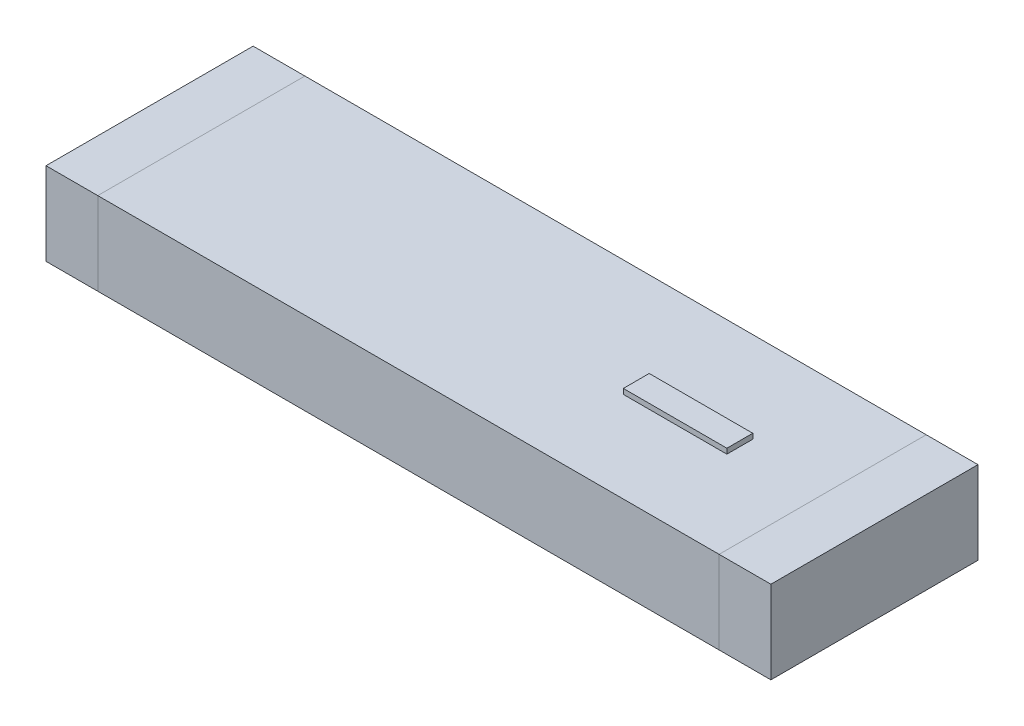
ISO-10303-21;
HEADER;
FILE_DESCRIPTION(('STEP AP214'),'2;1');
FILE_NAME('part.step','',(''),(''),'','','');
FILE_SCHEMA(('AUTOMOTIVE_DESIGN { 1 0 10303 214 1 1 1 1 }'));
ENDSEC;
DATA;
#1=APPLICATION_CONTEXT('core data for automotive mechanical design processes');
#2=APPLICATION_PROTOCOL_DEFINITION('international standard','automotive_design',2000,#1);
#3=PRODUCT_CONTEXT('',#1,'mechanical');
#4=PRODUCT('Part','Part','',(#3));
#5=PRODUCT_RELATED_PRODUCT_CATEGORY('part','',(#4));
#6=PRODUCT_DEFINITION_FORMATION('','',#4);
#7=PRODUCT_DEFINITION_CONTEXT('part definition',#1,'design');
#8=PRODUCT_DEFINITION('design','',#6,#7);
#9=PRODUCT_DEFINITION_SHAPE('','',#8);
#10=(LENGTH_UNIT() NAMED_UNIT(*) SI_UNIT(.MILLI.,.METRE.));
#11=(NAMED_UNIT(*) PLANE_ANGLE_UNIT() SI_UNIT($,.RADIAN.));
#12=(NAMED_UNIT(*) SI_UNIT($,.STERADIAN.) SOLID_ANGLE_UNIT());
#13=UNCERTAINTY_MEASURE_WITH_UNIT(LENGTH_MEASURE(1.E-05),#10,'distance_accuracy_value','');
#14=(GEOMETRIC_REPRESENTATION_CONTEXT(3) GLOBAL_UNCERTAINTY_ASSIGNED_CONTEXT((#13)) GLOBAL_UNIT_ASSIGNED_CONTEXT((#10,
#11,#12)) REPRESENTATION_CONTEXT('',''));
#15=CARTESIAN_POINT('',(0.,0.,0.));
#16=DIRECTION('',(0.,0.,1.));
#17=DIRECTION('',(1.,0.,0.));
#18=AXIS2_PLACEMENT_3D('',#15,#16,#17);
#19=CARTESIAN_POINT('',(2.2,0.75,0.125));
#20=DIRECTION('',(1.,0.,0.));
#21=DIRECTION('',(0.,0.,-1.));
#22=AXIS2_PLACEMENT_3D('',#19,#20,#21);
#23=PLANE('',#22);
#24=DIRECTION('',(0.,0.,-1.));
#25=VECTOR('',#24,1.);
#26=CARTESIAN_POINT('',(2.2,0.85,0.125));
#27=LINE('',#26,#25);
#28=CARTESIAN_POINT('',(2.2,0.85,0.125));
#29=VERTEX_POINT('',#28);
#30=CARTESIAN_POINT('',(2.2,0.85,-0.125));
#31=VERTEX_POINT('',#30);
#32=EDGE_CURVE('E108',#29,#31,#27,.T.);
#33=ORIENTED_EDGE('',*,*,#32,.F.);
#34=DIRECTION('',(0.,1.,0.));
#35=VECTOR('',#34,1.);
#36=CARTESIAN_POINT('',(2.2,0.75,0.125));
#37=LINE('',#36,#35);
#38=CARTESIAN_POINT('',(2.2,0.75,0.125));
#39=VERTEX_POINT('',#38);
#40=EDGE_CURVE('E12',#39,#29,#37,.T.);
#41=ORIENTED_EDGE('',*,*,#40,.F.);
#42=DIRECTION('',(0.,0.,-1.));
#43=VECTOR('',#42,1.);
#44=CARTESIAN_POINT('',(2.2,0.75,0.125));
#45=LINE('',#44,#43);
#46=CARTESIAN_POINT('',(2.2,0.75,-0.125));
#47=VERTEX_POINT('',#46);
#48=EDGE_CURVE('E102',#39,#47,#45,.T.);
#49=ORIENTED_EDGE('',*,*,#48,.T.);
#50=DIRECTION('',(0.,1.,0.));
#51=VECTOR('',#50,1.);
#52=CARTESIAN_POINT('',(2.2,0.75,-0.125));
#53=LINE('',#52,#51);
#54=EDGE_CURVE('E47',#47,#31,#53,.T.);
#55=ORIENTED_EDGE('',*,*,#54,.T.);
#56=EDGE_LOOP('',(#33,#41,#49,#55));
#57=FACE_BOUND('',#56,.T.);
#58=ADVANCED_FACE('F44',(#57),#23,.T.);
#59=CARTESIAN_POINT('',(1.2,0.75,0.125));
#60=DIRECTION('',(0.,0.,1.));
#61=DIRECTION('',(1.,0.,0.));
#62=AXIS2_PLACEMENT_3D('',#59,#60,#61);
#63=PLANE('',#62);
#64=DIRECTION('',(1.,0.,0.));
#65=VECTOR('',#64,1.);
#66=CARTESIAN_POINT('',(1.2,0.85,0.125));
#67=LINE('',#66,#65);
#68=CARTESIAN_POINT('',(1.2,0.85,0.125));
#69=VERTEX_POINT('',#68);
#70=EDGE_CURVE('E104',#69,#29,#67,.T.);
#71=ORIENTED_EDGE('',*,*,#70,.F.);
#72=DIRECTION('',(0.,1.,0.));
#73=VECTOR('',#72,1.);
#74=CARTESIAN_POINT('',(1.2,0.75,0.125));
#75=LINE('',#74,#73);
#76=CARTESIAN_POINT('',(1.2,0.75,0.125));
#77=VERTEX_POINT('',#76);
#78=EDGE_CURVE('E53',#77,#69,#75,.T.);
#79=ORIENTED_EDGE('',*,*,#78,.F.);
#80=DIRECTION('',(1.,0.,0.));
#81=VECTOR('',#80,1.);
#82=CARTESIAN_POINT('',(1.2,0.75,0.125));
#83=LINE('',#82,#81);
#84=EDGE_CURVE('E99',#77,#39,#83,.T.);
#85=ORIENTED_EDGE('',*,*,#84,.T.);
#86=ORIENTED_EDGE('',*,*,#40,.T.);
#87=EDGE_LOOP('',(#71,#79,#85,#86));
#88=FACE_BOUND('',#87,.T.);
#89=ADVANCED_FACE('F118',(#88),#63,.T.);
#90=CARTESIAN_POINT('',(1.2,0.75,0.125));
#91=DIRECTION('',(-1.,0.,0.));
#92=DIRECTION('',(0.,0.,1.));
#93=AXIS2_PLACEMENT_3D('',#90,#91,#92);
#94=PLANE('',#93);
#95=DIRECTION('',(0.,0.,1.));
#96=VECTOR('',#95,1.);
#97=CARTESIAN_POINT('',(1.2,0.85,0.125));
#98=LINE('',#97,#96);
#99=CARTESIAN_POINT('',(1.2,0.85,-0.125));
#100=VERTEX_POINT('',#99);
#101=EDGE_CURVE('E94',#100,#69,#98,.T.);
#102=ORIENTED_EDGE('',*,*,#101,.F.);
#103=DIRECTION('',(0.,1.,0.));
#104=VECTOR('',#103,1.);
#105=CARTESIAN_POINT('',(1.2,0.75,-0.125));
#106=LINE('',#105,#104);
#107=CARTESIAN_POINT('',(1.2,0.75,-0.125));
#108=VERTEX_POINT('',#107);
#109=EDGE_CURVE('E89',#108,#100,#106,.T.);
#110=ORIENTED_EDGE('',*,*,#109,.F.);
#111=DIRECTION('',(0.,0.,1.));
#112=VECTOR('',#111,1.);
#113=CARTESIAN_POINT('',(1.2,0.75,0.125));
#114=LINE('',#113,#112);
#115=EDGE_CURVE('E92',#108,#77,#114,.T.);
#116=ORIENTED_EDGE('',*,*,#115,.T.);
#117=ORIENTED_EDGE('',*,*,#78,.T.);
#118=EDGE_LOOP('',(#102,#110,#116,#117));
#119=FACE_BOUND('',#118,.T.);
#120=ADVANCED_FACE('F91',(#119),#94,.T.);
#121=CARTESIAN_POINT('',(1.2,0.75,-0.125));
#122=DIRECTION('',(0.,0.,-1.));
#123=DIRECTION('',(-1.,0.,0.));
#124=AXIS2_PLACEMENT_3D('',#121,#122,#123);
#125=PLANE('',#124);
#126=DIRECTION('',(-1.,0.,0.));
#127=VECTOR('',#126,1.);
#128=CARTESIAN_POINT('',(1.2,0.85,-0.125));
#129=LINE('',#128,#127);
#130=EDGE_CURVE('E111',#31,#100,#129,.T.);
#131=ORIENTED_EDGE('',*,*,#130,.F.);
#132=ORIENTED_EDGE('',*,*,#54,.F.);
#133=DIRECTION('',(-1.,0.,0.));
#134=VECTOR('',#133,1.);
#135=CARTESIAN_POINT('',(1.2,0.75,-0.125));
#136=LINE('',#135,#134);
#137=EDGE_CURVE('E98',#47,#108,#136,.T.);
#138=ORIENTED_EDGE('',*,*,#137,.T.);
#139=ORIENTED_EDGE('',*,*,#109,.T.);
#140=EDGE_LOOP('',(#131,#132,#138,#139));
#141=FACE_BOUND('',#140,.T.);
#142=ADVANCED_FACE('F101',(#141),#125,.T.);
#143=CARTESIAN_POINT('',(0.,0.75,0.));
#144=DIRECTION('',(0.,-1.,0.));
#145=DIRECTION('',(0.,0.,-1.));
#146=AXIS2_PLACEMENT_3D('',#143,#144,#145);
#147=PLANE('',#146);
#148=ORIENTED_EDGE('',*,*,#48,.F.);
#149=ORIENTED_EDGE('',*,*,#84,.F.);
#150=ORIENTED_EDGE('',*,*,#115,.F.);
#151=ORIENTED_EDGE('',*,*,#137,.F.);
#152=EDGE_LOOP('',(#148,#149,#150,#151));
#153=FACE_BOUND('',#152,.T.);
#154=ADVANCED_FACE('F97',(#153),#147,.T.);
#155=CARTESIAN_POINT('',(0.,0.85,0.));
#156=DIRECTION('',(0.,-1.,0.));
#157=DIRECTION('',(0.,0.,-1.));
#158=AXIS2_PLACEMENT_3D('',#155,#156,#157);
#159=PLANE('',#158);
#160=ORIENTED_EDGE('',*,*,#32,.T.);
#161=ORIENTED_EDGE('',*,*,#130,.T.);
#162=ORIENTED_EDGE('',*,*,#101,.T.);
#163=ORIENTED_EDGE('',*,*,#70,.T.);
#164=EDGE_LOOP('',(#160,#161,#162,#163));
#165=FACE_BOUND('',#164,.T.);
#166=ADVANCED_FACE('F117',(#165),#159,.F.);
#167=CLOSED_SHELL('',(#58,#89,#120,#142,#154,#166));
#168=MANIFOLD_SOLID_BREP('B2',#167);
#169=CARTESIAN_POINT('',(3.,0.8,-1.));
#170=DIRECTION('',(1.,0.,0.));
#171=DIRECTION('',(0.,0.,-1.));
#172=AXIS2_PLACEMENT_3D('',#169,#170,#171);
#173=PLANE('',#172);
#174=DIRECTION('',(0.,0.,1.));
#175=VECTOR('',#174,1.);
#176=CARTESIAN_POINT('',(3.,0.,-1.));
#177=LINE('',#176,#175);
#178=CARTESIAN_POINT('',(3.,0.,-1.));
#179=VERTEX_POINT('',#178);
#180=CARTESIAN_POINT('',(3.,0.,1.));
#181=VERTEX_POINT('',#180);
#182=EDGE_CURVE('E241',#179,#181,#177,.T.);
#183=ORIENTED_EDGE('',*,*,#182,.T.);
#184=DIRECTION('',(0.,-1.,0.));
#185=VECTOR('',#184,1.);
#186=CARTESIAN_POINT('',(3.,0.8,1.));
#187=LINE('',#186,#185);
#188=CARTESIAN_POINT('',(3.,0.8,1.));
#189=VERTEX_POINT('',#188);
#190=EDGE_CURVE('E42',#189,#181,#187,.T.);
#191=ORIENTED_EDGE('',*,*,#190,.F.);
#192=DIRECTION('',(0.,0.,1.));
#193=VECTOR('',#192,1.);
#194=CARTESIAN_POINT('',(3.,0.8,-1.));
#195=LINE('',#194,#193);
#196=CARTESIAN_POINT('',(3.,0.8,-1.));
#197=VERTEX_POINT('',#196);
#198=EDGE_CURVE('E229',#197,#189,#195,.T.);
#199=ORIENTED_EDGE('',*,*,#198,.F.);
#200=DIRECTION('',(0.,-1.,0.));
#201=VECTOR('',#200,1.);
#202=CARTESIAN_POINT('',(3.,0.8,-1.));
#203=LINE('',#202,#201);
#204=EDGE_CURVE('E237',#197,#179,#203,.T.);
#205=ORIENTED_EDGE('',*,*,#204,.T.);
#206=EDGE_LOOP('',(#183,#191,#199,#205));
#207=FACE_BOUND('',#206,.T.);
#208=ADVANCED_FACE('F178',(#207),#173,.F.);
#209=CARTESIAN_POINT('',(3.,0.8,1.));
#210=DIRECTION('',(0.,0.,-1.));
#211=DIRECTION('',(-1.,0.,0.));
#212=AXIS2_PLACEMENT_3D('',#209,#210,#211);
#213=PLANE('',#212);
#214=DIRECTION('',(1.,0.,0.));
#215=VECTOR('',#214,1.);
#216=CARTESIAN_POINT('',(3.,0.,1.));
#217=LINE('',#216,#215);
#218=CARTESIAN_POINT('',(3.5,0.,1.));
#219=VERTEX_POINT('',#218);
#220=EDGE_CURVE('E233',#181,#219,#217,.T.);
#221=ORIENTED_EDGE('',*,*,#220,.T.);
#222=DIRECTION('',(0.,-1.,0.));
#223=VECTOR('',#222,1.);
#224=CARTESIAN_POINT('',(3.5,0.8,1.));
#225=LINE('',#224,#223);
#226=CARTESIAN_POINT('',(3.5,0.8,1.));
#227=VERTEX_POINT('',#226);
#228=EDGE_CURVE('E186',#227,#219,#225,.T.);
#229=ORIENTED_EDGE('',*,*,#228,.F.);
#230=DIRECTION('',(1.,0.,0.));
#231=VECTOR('',#230,1.);
#232=CARTESIAN_POINT('',(3.,0.8,1.));
#233=LINE('',#232,#231);
#234=EDGE_CURVE('E224',#189,#227,#233,.T.);
#235=ORIENTED_EDGE('',*,*,#234,.F.);
#236=ORIENTED_EDGE('',*,*,#190,.T.);
#237=EDGE_LOOP('',(#221,#229,#235,#236));
#238=FACE_BOUND('',#237,.T.);
#239=ADVANCED_FACE('F232',(#238),#213,.F.);
#240=CARTESIAN_POINT('',(3.5,0.8,-1.));
#241=DIRECTION('',(-1.,0.,0.));
#242=DIRECTION('',(0.,0.,1.));
#243=AXIS2_PLACEMENT_3D('',#240,#241,#242);
#244=PLANE('',#243);
#245=DIRECTION('',(0.,0.,-1.));
#246=VECTOR('',#245,1.);
#247=CARTESIAN_POINT('',(3.5,0.,-1.));
#248=LINE('',#247,#246);
#249=CARTESIAN_POINT('',(3.5,0.,-1.));
#250=VERTEX_POINT('',#249);
#251=EDGE_CURVE('E211',#219,#250,#248,.T.);
#252=ORIENTED_EDGE('',*,*,#251,.T.);
#253=DIRECTION('',(0.,-1.,0.));
#254=VECTOR('',#253,1.);
#255=CARTESIAN_POINT('',(3.5,0.8,-1.));
#256=LINE('',#255,#254);
#257=CARTESIAN_POINT('',(3.5,0.8,-1.));
#258=VERTEX_POINT('',#257);
#259=EDGE_CURVE('E234',#258,#250,#256,.T.);
#260=ORIENTED_EDGE('',*,*,#259,.F.);
#261=DIRECTION('',(0.,0.,-1.));
#262=VECTOR('',#261,1.);
#263=CARTESIAN_POINT('',(3.5,0.8,-1.));
#264=LINE('',#263,#262);
#265=EDGE_CURVE('E227',#227,#258,#264,.T.);
#266=ORIENTED_EDGE('',*,*,#265,.F.);
#267=ORIENTED_EDGE('',*,*,#228,.T.);
#268=EDGE_LOOP('',(#252,#260,#266,#267));
#269=FACE_BOUND('',#268,.T.);
#270=ADVANCED_FACE('F235',(#269),#244,.F.);
#271=CARTESIAN_POINT('',(3.,0.8,-1.));
#272=DIRECTION('',(0.,0.,1.));
#273=DIRECTION('',(1.,0.,0.));
#274=AXIS2_PLACEMENT_3D('',#271,#272,#273);
#275=PLANE('',#274);
#276=DIRECTION('',(-1.,0.,0.));
#277=VECTOR('',#276,1.);
#278=CARTESIAN_POINT('',(3.,0.,-1.));
#279=LINE('',#278,#277);
#280=EDGE_CURVE('E217',#250,#179,#279,.T.);
#281=ORIENTED_EDGE('',*,*,#280,.T.);
#282=ORIENTED_EDGE('',*,*,#204,.F.);
#283=DIRECTION('',(-1.,0.,0.));
#284=VECTOR('',#283,1.);
#285=CARTESIAN_POINT('',(3.,0.8,-1.));
#286=LINE('',#285,#284);
#287=EDGE_CURVE('E194',#258,#197,#286,.T.);
#288=ORIENTED_EDGE('',*,*,#287,.F.);
#289=ORIENTED_EDGE('',*,*,#259,.T.);
#290=EDGE_LOOP('',(#281,#282,#288,#289));
#291=FACE_BOUND('',#290,.T.);
#292=ADVANCED_FACE('F248',(#291),#275,.F.);
#293=CARTESIAN_POINT('',(0.,0.8,0.));
#294=DIRECTION('',(0.,1.,0.));
#295=DIRECTION('',(0.,0.,1.));
#296=AXIS2_PLACEMENT_3D('',#293,#294,#295);
#297=PLANE('',#296);
#298=ORIENTED_EDGE('',*,*,#198,.T.);
#299=ORIENTED_EDGE('',*,*,#234,.T.);
#300=ORIENTED_EDGE('',*,*,#265,.T.);
#301=ORIENTED_EDGE('',*,*,#287,.T.);
#302=EDGE_LOOP('',(#298,#299,#300,#301));
#303=FACE_BOUND('',#302,.T.);
#304=ADVANCED_FACE('F225',(#303),#297,.T.);
#305=CARTESIAN_POINT('',(0.,0.,0.));
#306=DIRECTION('',(0.,1.,0.));
#307=DIRECTION('',(0.,0.,1.));
#308=AXIS2_PLACEMENT_3D('',#305,#306,#307);
#309=PLANE('',#308);
#310=ORIENTED_EDGE('',*,*,#182,.F.);
#311=ORIENTED_EDGE('',*,*,#280,.F.);
#312=ORIENTED_EDGE('',*,*,#251,.F.);
#313=ORIENTED_EDGE('',*,*,#220,.F.);
#314=EDGE_LOOP('',(#310,#311,#312,#313));
#315=FACE_BOUND('',#314,.T.);
#316=ADVANCED_FACE('F251',(#315),#309,.F.);
#317=CLOSED_SHELL('',(#208,#239,#270,#292,#304,#316));
#318=MANIFOLD_SOLID_BREP('B6',#317);
#319=CARTESIAN_POINT('',(-3.,0.8,-1.));
#320=DIRECTION('',(-1.,0.,0.));
#321=DIRECTION('',(0.,0.,1.));
#322=AXIS2_PLACEMENT_3D('',#319,#320,#321);
#323=PLANE('',#322);
#324=DIRECTION('',(0.,0.,-1.));
#325=VECTOR('',#324,1.);
#326=CARTESIAN_POINT('',(-3.,0.,-1.));
#327=LINE('',#326,#325);
#328=CARTESIAN_POINT('',(-3.,0.,1.));
#329=VERTEX_POINT('',#328);
#330=CARTESIAN_POINT('',(-3.,0.,-1.));
#331=VERTEX_POINT('',#330);
#332=EDGE_CURVE('E374',#329,#331,#327,.T.);
#333=ORIENTED_EDGE('',*,*,#332,.T.);
#334=DIRECTION('',(0.,-1.,0.));
#335=VECTOR('',#334,1.);
#336=CARTESIAN_POINT('',(-3.,0.8,-1.));
#337=LINE('',#336,#335);
#338=CARTESIAN_POINT('',(-3.,0.8,-1.));
#339=VERTEX_POINT('',#338);
#340=EDGE_CURVE('E176',#339,#331,#337,.T.);
#341=ORIENTED_EDGE('',*,*,#340,.F.);
#342=DIRECTION('',(0.,0.,-1.));
#343=VECTOR('',#342,1.);
#344=CARTESIAN_POINT('',(-3.,0.8,-1.));
#345=LINE('',#344,#343);
#346=CARTESIAN_POINT('',(-3.,0.8,1.));
#347=VERTEX_POINT('',#346);
#348=EDGE_CURVE('E362',#347,#339,#345,.T.);
#349=ORIENTED_EDGE('',*,*,#348,.F.);
#350=DIRECTION('',(0.,-1.,0.));
#351=VECTOR('',#350,1.);
#352=CARTESIAN_POINT('',(-3.,0.8,1.));
#353=LINE('',#352,#351);
#354=EDGE_CURVE('E370',#347,#329,#353,.T.);
#355=ORIENTED_EDGE('',*,*,#354,.T.);
#356=EDGE_LOOP('',(#333,#341,#349,#355));
#357=FACE_BOUND('',#356,.T.);
#358=ADVANCED_FACE('F311',(#357),#323,.F.);
#359=CARTESIAN_POINT('',(-3.,0.8,-1.));
#360=DIRECTION('',(0.,0.,1.));
#361=DIRECTION('',(1.,0.,0.));
#362=AXIS2_PLACEMENT_3D('',#359,#360,#361);
#363=PLANE('',#362);
#364=DIRECTION('',(-1.,0.,0.));
#365=VECTOR('',#364,1.);
#366=CARTESIAN_POINT('',(-3.,0.,-1.));
#367=LINE('',#366,#365);
#368=CARTESIAN_POINT('',(-3.5,0.,-1.));
#369=VERTEX_POINT('',#368);
#370=EDGE_CURVE('E366',#331,#369,#367,.T.);
#371=ORIENTED_EDGE('',*,*,#370,.T.);
#372=DIRECTION('',(0.,-1.,0.));
#373=VECTOR('',#372,1.);
#374=CARTESIAN_POINT('',(-3.5,0.8,-1.));
#375=LINE('',#374,#373);
#376=CARTESIAN_POINT('',(-3.5,0.8,-1.));
#377=VERTEX_POINT('',#376);
#378=EDGE_CURVE('E319',#377,#369,#375,.T.);
#379=ORIENTED_EDGE('',*,*,#378,.F.);
#380=DIRECTION('',(-1.,0.,0.));
#381=VECTOR('',#380,1.);
#382=CARTESIAN_POINT('',(-3.,0.8,-1.));
#383=LINE('',#382,#381);
#384=EDGE_CURVE('E357',#339,#377,#383,.T.);
#385=ORIENTED_EDGE('',*,*,#384,.F.);
#386=ORIENTED_EDGE('',*,*,#340,.T.);
#387=EDGE_LOOP('',(#371,#379,#385,#386));
#388=FACE_BOUND('',#387,.T.);
#389=ADVANCED_FACE('F365',(#388),#363,.F.);
#390=CARTESIAN_POINT('',(-3.5,0.8,-1.));
#391=DIRECTION('',(1.,0.,0.));
#392=DIRECTION('',(0.,0.,-1.));
#393=AXIS2_PLACEMENT_3D('',#390,#391,#392);
#394=PLANE('',#393);
#395=DIRECTION('',(0.,0.,1.));
#396=VECTOR('',#395,1.);
#397=CARTESIAN_POINT('',(-3.5,0.,-1.));
#398=LINE('',#397,#396);
#399=CARTESIAN_POINT('',(-3.5,0.,1.));
#400=VERTEX_POINT('',#399);
#401=EDGE_CURVE('E344',#369,#400,#398,.T.);
#402=ORIENTED_EDGE('',*,*,#401,.T.);
#403=DIRECTION('',(0.,-1.,0.));
#404=VECTOR('',#403,1.);
#405=CARTESIAN_POINT('',(-3.5,0.8,1.));
#406=LINE('',#405,#404);
#407=CARTESIAN_POINT('',(-3.5,0.8,1.));
#408=VERTEX_POINT('',#407);
#409=EDGE_CURVE('E367',#408,#400,#406,.T.);
#410=ORIENTED_EDGE('',*,*,#409,.F.);
#411=DIRECTION('',(0.,0.,1.));
#412=VECTOR('',#411,1.);
#413=CARTESIAN_POINT('',(-3.5,0.8,-1.));
#414=LINE('',#413,#412);
#415=EDGE_CURVE('E360',#377,#408,#414,.T.);
#416=ORIENTED_EDGE('',*,*,#415,.F.);
#417=ORIENTED_EDGE('',*,*,#378,.T.);
#418=EDGE_LOOP('',(#402,#410,#416,#417));
#419=FACE_BOUND('',#418,.T.);
#420=ADVANCED_FACE('F368',(#419),#394,.F.);
#421=CARTESIAN_POINT('',(-3.,0.8,1.));
#422=DIRECTION('',(0.,0.,-1.));
#423=DIRECTION('',(-1.,0.,0.));
#424=AXIS2_PLACEMENT_3D('',#421,#422,#423);
#425=PLANE('',#424);
#426=DIRECTION('',(1.,0.,0.));
#427=VECTOR('',#426,1.);
#428=CARTESIAN_POINT('',(-3.,0.,1.));
#429=LINE('',#428,#427);
#430=EDGE_CURVE('E350',#400,#329,#429,.T.);
#431=ORIENTED_EDGE('',*,*,#430,.T.);
#432=ORIENTED_EDGE('',*,*,#354,.F.);
#433=DIRECTION('',(1.,0.,0.));
#434=VECTOR('',#433,1.);
#435=CARTESIAN_POINT('',(-3.,0.8,1.));
#436=LINE('',#435,#434);
#437=EDGE_CURVE('E327',#408,#347,#436,.T.);
#438=ORIENTED_EDGE('',*,*,#437,.F.);
#439=ORIENTED_EDGE('',*,*,#409,.T.);
#440=EDGE_LOOP('',(#431,#432,#438,#439));
#441=FACE_BOUND('',#440,.T.);
#442=ADVANCED_FACE('F381',(#441),#425,.F.);
#443=CARTESIAN_POINT('',(0.,0.8,0.));
#444=DIRECTION('',(0.,-1.,0.));
#445=DIRECTION('',(0.,0.,-1.));
#446=AXIS2_PLACEMENT_3D('',#443,#444,#445);
#447=PLANE('',#446);
#448=ORIENTED_EDGE('',*,*,#348,.T.);
#449=ORIENTED_EDGE('',*,*,#384,.T.);
#450=ORIENTED_EDGE('',*,*,#415,.T.);
#451=ORIENTED_EDGE('',*,*,#437,.T.);
#452=EDGE_LOOP('',(#448,#449,#450,#451));
#453=FACE_BOUND('',#452,.T.);
#454=ADVANCED_FACE('F358',(#453),#447,.F.);
#455=CARTESIAN_POINT('',(0.,0.,0.));
#456=DIRECTION('',(0.,-1.,0.));
#457=DIRECTION('',(0.,0.,-1.));
#458=AXIS2_PLACEMENT_3D('',#455,#456,#457);
#459=PLANE('',#458);
#460=ORIENTED_EDGE('',*,*,#332,.F.);
#461=ORIENTED_EDGE('',*,*,#430,.F.);
#462=ORIENTED_EDGE('',*,*,#401,.F.);
#463=ORIENTED_EDGE('',*,*,#370,.F.);
#464=EDGE_LOOP('',(#460,#461,#462,#463));
#465=FACE_BOUND('',#464,.T.);
#466=ADVANCED_FACE('F384',(#465),#459,.T.);
#467=CLOSED_SHELL('',(#358,#389,#420,#442,#454,#466));
#468=MANIFOLD_SOLID_BREP('B36',#467);
#469=CARTESIAN_POINT('',(3.,0.8,1.));
#470=DIRECTION('',(-1.,0.,0.));
#471=DIRECTION('',(0.,0.,1.));
#472=AXIS2_PLACEMENT_3D('',#469,#470,#471);
#473=PLANE('',#472);
#474=DIRECTION('',(0.,0.,-1.));
#475=VECTOR('',#474,1.);
#476=CARTESIAN_POINT('',(3.,0.,1.));
#477=LINE('',#476,#475);
#478=CARTESIAN_POINT('',(3.,0.,1.));
#479=VERTEX_POINT('',#478);
#480=CARTESIAN_POINT('',(3.,0.,-1.));
#481=VERTEX_POINT('',#480);
#482=EDGE_CURVE('E498',#479,#481,#477,.T.);
#483=ORIENTED_EDGE('',*,*,#482,.T.);
#484=DIRECTION('',(0.,-1.,0.));
#485=VECTOR('',#484,1.);
#486=CARTESIAN_POINT('',(3.,0.8,-1.));
#487=LINE('',#486,#485);
#488=CARTESIAN_POINT('',(3.,0.8,-1.));
#489=VERTEX_POINT('',#488);
#490=EDGE_CURVE('E309',#489,#481,#487,.T.);
#491=ORIENTED_EDGE('',*,*,#490,.F.);
#492=DIRECTION('',(0.,0.,-1.));
#493=VECTOR('',#492,1.);
#494=CARTESIAN_POINT('',(3.,0.8,1.));
#495=LINE('',#494,#493);
#496=CARTESIAN_POINT('',(3.,0.8,1.));
#497=VERTEX_POINT('',#496);
#498=EDGE_CURVE('E486',#497,#489,#495,.T.);
#499=ORIENTED_EDGE('',*,*,#498,.F.);
#500=DIRECTION('',(0.,-1.,0.));
#501=VECTOR('',#500,1.);
#502=CARTESIAN_POINT('',(3.,0.8,1.));
#503=LINE('',#502,#501);
#504=EDGE_CURVE('E494',#497,#479,#503,.T.);
#505=ORIENTED_EDGE('',*,*,#504,.T.);
#506=EDGE_LOOP('',(#483,#491,#499,#505));
#507=FACE_BOUND('',#506,.T.);
#508=ADVANCED_FACE('F435',(#507),#473,.F.);
#509=CARTESIAN_POINT('',(-3.,0.8,-1.));
#510=DIRECTION('',(0.,0.,1.));
#511=DIRECTION('',(1.,0.,0.));
#512=AXIS2_PLACEMENT_3D('',#509,#510,#511);
#513=PLANE('',#512);
#514=DIRECTION('',(-1.,0.,0.));
#515=VECTOR('',#514,1.);
#516=CARTESIAN_POINT('',(-3.,0.,-1.));
#517=LINE('',#516,#515);
#518=CARTESIAN_POINT('',(-3.,0.,-1.));
#519=VERTEX_POINT('',#518);
#520=EDGE_CURVE('E490',#481,#519,#517,.T.);
#521=ORIENTED_EDGE('',*,*,#520,.T.);
#522=DIRECTION('',(0.,-1.,0.));
#523=VECTOR('',#522,1.);
#524=CARTESIAN_POINT('',(-3.,0.8,-1.));
#525=LINE('',#524,#523);
#526=CARTESIAN_POINT('',(-3.,0.8,-1.));
#527=VERTEX_POINT('',#526);
#528=EDGE_CURVE('E443',#527,#519,#525,.T.);
#529=ORIENTED_EDGE('',*,*,#528,.F.);
#530=DIRECTION('',(-1.,0.,0.));
#531=VECTOR('',#530,1.);
#532=CARTESIAN_POINT('',(-3.,0.8,-1.));
#533=LINE('',#532,#531);
#534=EDGE_CURVE('E481',#489,#527,#533,.T.);
#535=ORIENTED_EDGE('',*,*,#534,.F.);
#536=ORIENTED_EDGE('',*,*,#490,.T.);
#537=EDGE_LOOP('',(#521,#529,#535,#536));
#538=FACE_BOUND('',#537,.T.);
#539=ADVANCED_FACE('F489',(#538),#513,.F.);
#540=CARTESIAN_POINT('',(-3.,0.8,1.));
#541=DIRECTION('',(1.,0.,0.));
#542=DIRECTION('',(0.,0.,-1.));
#543=AXIS2_PLACEMENT_3D('',#540,#541,#542);
#544=PLANE('',#543);
#545=DIRECTION('',(0.,0.,1.));
#546=VECTOR('',#545,1.);
#547=CARTESIAN_POINT('',(-3.,0.,1.));
#548=LINE('',#547,#546);
#549=CARTESIAN_POINT('',(-3.,0.,1.));
#550=VERTEX_POINT('',#549);
#551=EDGE_CURVE('E468',#519,#550,#548,.T.);
#552=ORIENTED_EDGE('',*,*,#551,.T.);
#553=DIRECTION('',(0.,-1.,0.));
#554=VECTOR('',#553,1.);
#555=CARTESIAN_POINT('',(-3.,0.8,1.));
#556=LINE('',#555,#554);
#557=CARTESIAN_POINT('',(-3.,0.8,1.));
#558=VERTEX_POINT('',#557);
#559=EDGE_CURVE('E491',#558,#550,#556,.T.);
#560=ORIENTED_EDGE('',*,*,#559,.F.);
#561=DIRECTION('',(0.,0.,1.));
#562=VECTOR('',#561,1.);
#563=CARTESIAN_POINT('',(-3.,0.8,1.));
#564=LINE('',#563,#562);
#565=EDGE_CURVE('E484',#527,#558,#564,.T.);
#566=ORIENTED_EDGE('',*,*,#565,.F.);
#567=ORIENTED_EDGE('',*,*,#528,.T.);
#568=EDGE_LOOP('',(#552,#560,#566,#567));
#569=FACE_BOUND('',#568,.T.);
#570=ADVANCED_FACE('F492',(#569),#544,.F.);
#571=CARTESIAN_POINT('',(-3.,0.8,1.));
#572=DIRECTION('',(0.,0.,-1.));
#573=DIRECTION('',(-1.,0.,0.));
#574=AXIS2_PLACEMENT_3D('',#571,#572,#573);
#575=PLANE('',#574);
#576=DIRECTION('',(1.,0.,0.));
#577=VECTOR('',#576,1.);
#578=CARTESIAN_POINT('',(-3.,0.,1.));
#579=LINE('',#578,#577);
#580=EDGE_CURVE('E474',#550,#479,#579,.T.);
#581=ORIENTED_EDGE('',*,*,#580,.T.);
#582=ORIENTED_EDGE('',*,*,#504,.F.);
#583=DIRECTION('',(1.,0.,0.));
#584=VECTOR('',#583,1.);
#585=CARTESIAN_POINT('',(-3.,0.8,1.));
#586=LINE('',#585,#584);
#587=EDGE_CURVE('E451',#558,#497,#586,.T.);
#588=ORIENTED_EDGE('',*,*,#587,.F.);
#589=ORIENTED_EDGE('',*,*,#559,.T.);
#590=EDGE_LOOP('',(#581,#582,#588,#589));
#591=FACE_BOUND('',#590,.T.);
#592=ADVANCED_FACE('F505',(#591),#575,.F.);
#593=CARTESIAN_POINT('',(0.,0.8,0.));
#594=DIRECTION('',(0.,-1.,0.));
#595=DIRECTION('',(0.,0.,-1.));
#596=AXIS2_PLACEMENT_3D('',#593,#594,#595);
#597=PLANE('',#596);
#598=ORIENTED_EDGE('',*,*,#498,.T.);
#599=ORIENTED_EDGE('',*,*,#534,.T.);
#600=ORIENTED_EDGE('',*,*,#565,.T.);
#601=ORIENTED_EDGE('',*,*,#587,.T.);
#602=EDGE_LOOP('',(#598,#599,#600,#601));
#603=FACE_BOUND('',#602,.T.);
#604=ADVANCED_FACE('F482',(#603),#597,.F.);
#605=CARTESIAN_POINT('',(0.,0.,0.));
#606=DIRECTION('',(0.,-1.,0.));
#607=DIRECTION('',(0.,0.,-1.));
#608=AXIS2_PLACEMENT_3D('',#605,#606,#607);
#609=PLANE('',#608);
#610=ORIENTED_EDGE('',*,*,#482,.F.);
#611=ORIENTED_EDGE('',*,*,#580,.F.);
#612=ORIENTED_EDGE('',*,*,#551,.F.);
#613=ORIENTED_EDGE('',*,*,#520,.F.);
#614=EDGE_LOOP('',(#610,#611,#612,#613));
#615=FACE_BOUND('',#614,.T.);
#616=ADVANCED_FACE('F508',(#615),#609,.T.);
#617=CLOSED_SHELL('',(#508,#539,#570,#592,#604,#616));
#618=MANIFOLD_SOLID_BREP('B170',#617);
#619=ADVANCED_BREP_SHAPE_REPRESENTATION('',(#18,#168,#318,#468,#618),#14);
#620=SHAPE_DEFINITION_REPRESENTATION(#9,#619);
ENDSEC;
END-ISO-10303-21;
